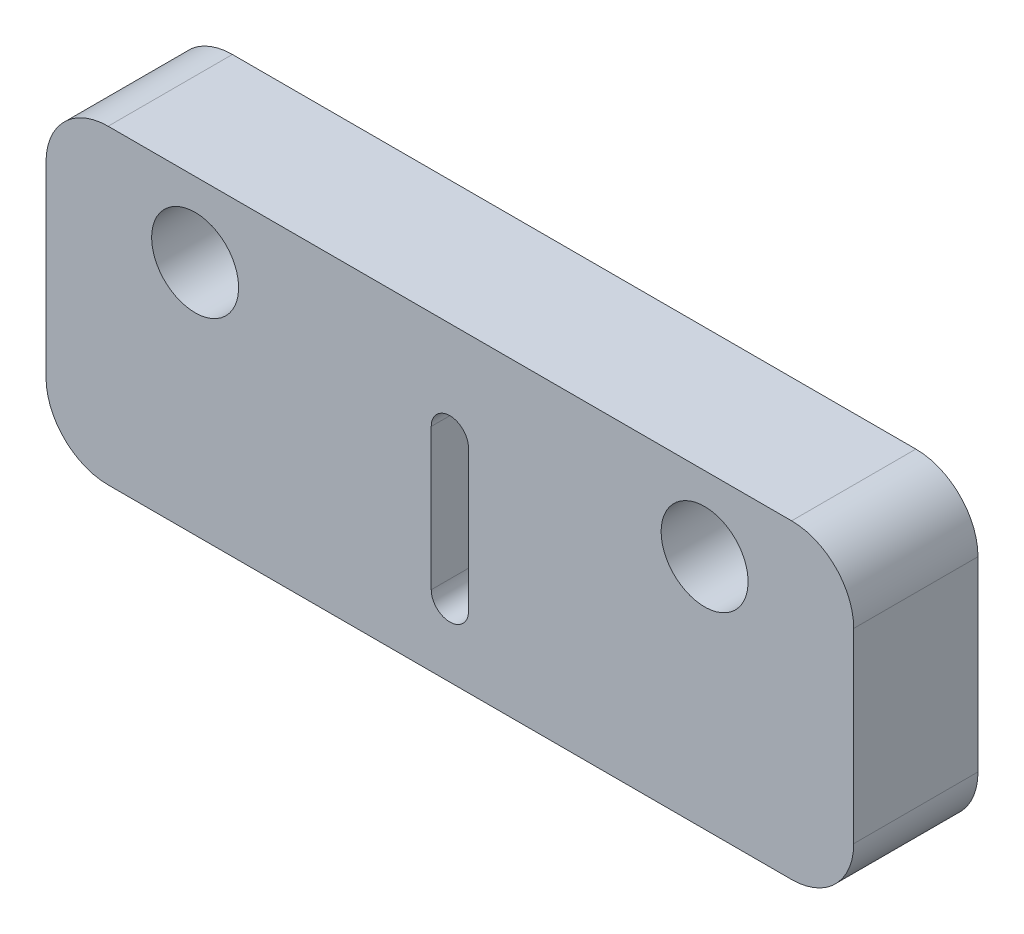
ISO-10303-21;
HEADER;
FILE_DESCRIPTION(('STEP AP214'),'2;1');
FILE_NAME('part.step','',(''),(''),'','','');
FILE_SCHEMA(('AUTOMOTIVE_DESIGN { 1 0 10303 214 1 1 1 1 }'));
ENDSEC;
DATA;
#1=APPLICATION_CONTEXT('core data for automotive mechanical design processes');
#2=APPLICATION_PROTOCOL_DEFINITION('international standard','automotive_design',2000,#1);
#3=PRODUCT_CONTEXT('',#1,'mechanical');
#4=PRODUCT('Part','Part','',(#3));
#5=PRODUCT_RELATED_PRODUCT_CATEGORY('part','',(#4));
#6=PRODUCT_DEFINITION_FORMATION('','',#4);
#7=PRODUCT_DEFINITION_CONTEXT('part definition',#1,'design');
#8=PRODUCT_DEFINITION('design','',#6,#7);
#9=PRODUCT_DEFINITION_SHAPE('','',#8);
#10=(LENGTH_UNIT() NAMED_UNIT(*) SI_UNIT(.MILLI.,.METRE.));
#11=(NAMED_UNIT(*) PLANE_ANGLE_UNIT() SI_UNIT($,.RADIAN.));
#12=(NAMED_UNIT(*) SI_UNIT($,.STERADIAN.) SOLID_ANGLE_UNIT());
#13=UNCERTAINTY_MEASURE_WITH_UNIT(LENGTH_MEASURE(1.E-05),#10,'distance_accuracy_value','');
#14=(GEOMETRIC_REPRESENTATION_CONTEXT(3) GLOBAL_UNCERTAINTY_ASSIGNED_CONTEXT((#13)) GLOBAL_UNIT_ASSIGNED_CONTEXT((#10,
#11,#12)) REPRESENTATION_CONTEXT('',''));
#15=CARTESIAN_POINT('',(0.,0.,0.));
#16=DIRECTION('',(0.,0.,1.));
#17=DIRECTION('',(1.,0.,0.));
#18=AXIS2_PLACEMENT_3D('',#15,#16,#17);
#19=CARTESIAN_POINT('',(-30.187265917603,25.,-10.3464419475655));
#20=DIRECTION('',(1.,0.,0.));
#21=DIRECTION('',(0.,0.,-1.));
#22=AXIS2_PLACEMENT_3D('',#19,#20,#21);
#23=PLANE('',#22);
#24=DIRECTION('',(0.,-1.,0.));
#25=VECTOR('',#24,1.);
#26=CARTESIAN_POINT('',(-30.187265917603,25.,-10.3464419475655));
#27=LINE('',#26,#25);
#28=CARTESIAN_POINT('',(-30.187265917603,20.,-10.3464419475655));
#29=VERTEX_POINT('',#28);
#30=CARTESIAN_POINT('',(-30.187265917603,5.,-10.3464419475655));
#31=VERTEX_POINT('',#30);
#32=EDGE_CURVE('E205',#29,#31,#27,.T.);
#33=ORIENTED_EDGE('',*,*,#32,.T.);
#34=DIRECTION('',(0.,0.,1.));
#35=VECTOR('',#34,1.);
#36=CARTESIAN_POINT('',(-30.187265917603,5.,-10.3464419475655));
#37=LINE('',#36,#35);
#38=CARTESIAN_POINT('',(-30.187265917603,5.,-0.346441947565543));
#39=VERTEX_POINT('',#38);
#40=EDGE_CURVE('E229',#31,#39,#37,.T.);
#41=ORIENTED_EDGE('',*,*,#40,.T.);
#42=DIRECTION('',(0.,-1.,0.));
#43=VECTOR('',#42,1.);
#44=CARTESIAN_POINT('',(-30.187265917603,25.,-0.346441947565543));
#45=LINE('',#44,#43);
#46=CARTESIAN_POINT('',(-30.187265917603,20.,-0.346441947565543));
#47=VERTEX_POINT('',#46);
#48=EDGE_CURVE('E222',#47,#39,#45,.T.);
#49=ORIENTED_EDGE('',*,*,#48,.F.);
#50=DIRECTION('',(0.,0.,1.));
#51=VECTOR('',#50,1.);
#52=CARTESIAN_POINT('',(-30.187265917603,20.,-10.3464419475655));
#53=LINE('',#52,#51);
#54=EDGE_CURVE('E226',#47,#29,#53,.F.);
#55=ORIENTED_EDGE('',*,*,#54,.T.);
#56=EDGE_LOOP('',(#33,#41,#49,#55));
#57=FACE_BOUND('',#56,.T.);
#58=ADVANCED_FACE('F39',(#57),#23,.F.);
#59=CARTESIAN_POINT('',(-30.187265917603,25.,-0.346441947565543));
#60=DIRECTION('',(0.,0.,-1.));
#61=DIRECTION('',(-1.,0.,0.));
#62=AXIS2_PLACEMENT_3D('',#59,#60,#61);
#63=PLANE('',#62);
#64=CARTESIAN_POINT('',(-18.187265917603,19.,-0.346441947565543));
#65=DIRECTION('',(0.,0.,-1.));
#66=DIRECTION('',(-1.,0.,0.));
#67=AXIS2_PLACEMENT_3D('',#64,#65,#66);
#68=CIRCLE('',#67,3.5);
#69=CARTESIAN_POINT('',(-21.687265917603,19.,-0.346441947565543));
#70=VERTEX_POINT('',#69);
#71=EDGE_CURVE('E191',#70,#70,#68,.T.);
#72=ORIENTED_EDGE('',*,*,#71,.T.);
#73=EDGE_LOOP('',(#72));
#74=FACE_BOUND('',#73,.T.);
#75=CARTESIAN_POINT('',(2.31273408239698,17.0770061257119,-0.346441947565543));
#76=DIRECTION('',(0.,0.,-1.));
#77=DIRECTION('',(-1.,0.,0.));
#78=AXIS2_PLACEMENT_3D('',#75,#76,#77);
#79=CIRCLE('',#78,1.49999999999999);
#80=CARTESIAN_POINT('',(0.812734082396988,17.0770061257119,-0.346441947565543));
#81=VERTEX_POINT('',#80);
#82=CARTESIAN_POINT('',(3.81273408239698,17.0770061257119,-0.346441947565543));
#83=VERTEX_POINT('',#82);
#84=EDGE_CURVE('E186',#81,#83,#79,.T.);
#85=ORIENTED_EDGE('',*,*,#84,.T.);
#86=DIRECTION('',(0.,-1.,0.));
#87=VECTOR('',#86,1.);
#88=CARTESIAN_POINT('',(3.81273408239698,25.,-0.346441947565543));
#89=LINE('',#88,#87);
#90=CARTESIAN_POINT('',(3.81273408239698,5.69617233331243,-0.346441947565543));
#91=VERTEX_POINT('',#90);
#92=EDGE_CURVE('E138',#83,#91,#89,.T.);
#93=ORIENTED_EDGE('',*,*,#92,.T.);
#94=CARTESIAN_POINT('',(2.31273408239698,5.69617233331243,-0.346441947565543));
#95=DIRECTION('',(0.,0.,-1.));
#96=DIRECTION('',(-1.,0.,0.));
#97=AXIS2_PLACEMENT_3D('',#94,#95,#96);
#98=CIRCLE('',#97,1.49999999999999);
#99=CARTESIAN_POINT('',(0.812734082396988,5.69617233331243,-0.346441947565543));
#100=VERTEX_POINT('',#99);
#101=EDGE_CURVE('E178',#91,#100,#98,.T.);
#102=ORIENTED_EDGE('',*,*,#101,.T.);
#103=DIRECTION('',(0.,-1.,0.));
#104=VECTOR('',#103,1.);
#105=CARTESIAN_POINT('',(0.812734082396988,25.,-0.346441947565543));
#106=LINE('',#105,#104);
#107=EDGE_CURVE('E182',#81,#100,#106,.T.);
#108=ORIENTED_EDGE('',*,*,#107,.F.);
#109=EDGE_LOOP('',(#85,#93,#102,#108));
#110=FACE_BOUND('',#109,.T.);
#111=CARTESIAN_POINT('',(22.812734082397,19.,-0.346441947565543));
#112=DIRECTION('',(0.,0.,-1.));
#113=DIRECTION('',(-1.,0.,0.));
#114=AXIS2_PLACEMENT_3D('',#111,#112,#113);
#115=CIRCLE('',#114,3.5);
#116=CARTESIAN_POINT('',(19.312734082397,19.,-0.346441947565543));
#117=VERTEX_POINT('',#116);
#118=EDGE_CURVE('E167',#117,#117,#115,.T.);
#119=ORIENTED_EDGE('',*,*,#118,.T.);
#120=EDGE_LOOP('',(#119));
#121=FACE_BOUND('',#120,.T.);
#122=ORIENTED_EDGE('',*,*,#48,.T.);
#123=CARTESIAN_POINT('',(-25.187265917603,5.,-0.346441947565543));
#124=DIRECTION('',(0.,0.,-1.));
#125=DIRECTION('',(-1.,0.,0.));
#126=AXIS2_PLACEMENT_3D('',#123,#124,#125);
#127=CIRCLE('',#126,5.);
#128=CARTESIAN_POINT('',(-25.187265917603,0.,-0.346441947565543));
#129=VERTEX_POINT('',#128);
#130=EDGE_CURVE('E242',#39,#129,#127,.F.);
#131=ORIENTED_EDGE('',*,*,#130,.T.);
#132=DIRECTION('',(1.,0.,0.));
#133=VECTOR('',#132,1.);
#134=CARTESIAN_POINT('',(-30.187265917603,0.,-0.346441947565543));
#135=LINE('',#134,#133);
#136=CARTESIAN_POINT('',(29.812734082397,0.,-0.346441947565543));
#137=VERTEX_POINT('',#136);
#138=EDGE_CURVE('E195',#129,#137,#135,.T.);
#139=ORIENTED_EDGE('',*,*,#138,.T.);
#140=CARTESIAN_POINT('',(29.812734082397,5.,-0.346441947565543));
#141=DIRECTION('',(0.,0.,-1.));
#142=DIRECTION('',(-1.,0.,0.));
#143=AXIS2_PLACEMENT_3D('',#140,#141,#142);
#144=CIRCLE('',#143,5.);
#145=CARTESIAN_POINT('',(34.812734082397,5.,-0.346441947565543));
#146=VERTEX_POINT('',#145);
#147=EDGE_CURVE('E239',#137,#146,#144,.F.);
#148=ORIENTED_EDGE('',*,*,#147,.T.);
#149=DIRECTION('',(0.,-1.,0.));
#150=VECTOR('',#149,1.);
#151=CARTESIAN_POINT('',(34.812734082397,25.,-0.346441947565543));
#152=LINE('',#151,#150);
#153=CARTESIAN_POINT('',(34.812734082397,20.,-0.346441947565543));
#154=VERTEX_POINT('',#153);
#155=EDGE_CURVE('E218',#154,#146,#152,.T.);
#156=ORIENTED_EDGE('',*,*,#155,.F.);
#157=CARTESIAN_POINT('',(29.812734082397,20.,-0.346441947565543));
#158=DIRECTION('',(0.,0.,-1.));
#159=DIRECTION('',(-1.,0.,0.));
#160=AXIS2_PLACEMENT_3D('',#157,#158,#159);
#161=CIRCLE('',#160,5.);
#162=CARTESIAN_POINT('',(29.812734082397,25.,-0.346441947565543));
#163=VERTEX_POINT('',#162);
#164=EDGE_CURVE('E236',#154,#163,#161,.F.);
#165=ORIENTED_EDGE('',*,*,#164,.T.);
#166=DIRECTION('',(1.,0.,0.));
#167=VECTOR('',#166,1.);
#168=CARTESIAN_POINT('',(-30.187265917603,25.,-0.346441947565543));
#169=LINE('',#168,#167);
#170=CARTESIAN_POINT('',(-25.187265917603,25.,-0.346441947565543));
#171=VERTEX_POINT('',#170);
#172=EDGE_CURVE('E196',#171,#163,#169,.T.);
#173=ORIENTED_EDGE('',*,*,#172,.F.);
#174=CARTESIAN_POINT('',(-25.187265917603,20.,-0.346441947565543));
#175=DIRECTION('',(0.,0.,-1.));
#176=DIRECTION('',(-1.,0.,0.));
#177=AXIS2_PLACEMENT_3D('',#174,#175,#176);
#178=CIRCLE('',#177,5.);
#179=EDGE_CURVE('E233',#171,#47,#178,.F.);
#180=ORIENTED_EDGE('',*,*,#179,.T.);
#181=EDGE_LOOP('',(#122,#131,#139,#148,#156,#165,#173,#180));
#182=FACE_BOUND('',#181,.T.);
#183=ADVANCED_FACE('F276',(#74,#110,#121,#182),#63,.F.);
#184=CARTESIAN_POINT('',(34.812734082397,25.,-10.3464419475655));
#185=DIRECTION('',(-1.,0.,0.));
#186=DIRECTION('',(0.,0.,1.));
#187=AXIS2_PLACEMENT_3D('',#184,#185,#186);
#188=PLANE('',#187);
#189=ORIENTED_EDGE('',*,*,#155,.T.);
#190=DIRECTION('',(0.,0.,-1.));
#191=VECTOR('',#190,1.);
#192=CARTESIAN_POINT('',(34.812734082397,5.,-10.3464419475655));
#193=LINE('',#192,#191);
#194=CARTESIAN_POINT('',(34.812734082397,5.,-10.3464419475655));
#195=VERTEX_POINT('',#194);
#196=EDGE_CURVE('E264',#146,#195,#193,.T.);
#197=ORIENTED_EDGE('',*,*,#196,.T.);
#198=DIRECTION('',(0.,-1.,0.));
#199=VECTOR('',#198,1.);
#200=CARTESIAN_POINT('',(34.812734082397,25.,-10.3464419475655));
#201=LINE('',#200,#199);
#202=CARTESIAN_POINT('',(34.812734082397,20.,-10.3464419475655));
#203=VERTEX_POINT('',#202);
#204=EDGE_CURVE('E215',#203,#195,#201,.T.);
#205=ORIENTED_EDGE('',*,*,#204,.F.);
#206=DIRECTION('',(0.,0.,-1.));
#207=VECTOR('',#206,1.);
#208=CARTESIAN_POINT('',(34.812734082397,20.,-0.346441947565543));
#209=LINE('',#208,#207);
#210=EDGE_CURVE('E261',#203,#154,#209,.F.);
#211=ORIENTED_EDGE('',*,*,#210,.T.);
#212=EDGE_LOOP('',(#189,#197,#205,#211));
#213=FACE_BOUND('',#212,.T.);
#214=ADVANCED_FACE('F298',(#213),#188,.F.);
#215=CARTESIAN_POINT('',(-30.187265917603,25.,-10.3464419475655));
#216=DIRECTION('',(0.,0.,1.));
#217=DIRECTION('',(1.,0.,0.));
#218=AXIS2_PLACEMENT_3D('',#215,#216,#217);
#219=PLANE('',#218);
#220=CARTESIAN_POINT('',(-18.187265917603,19.,-10.3464419475655));
#221=DIRECTION('',(0.,0.,-1.));
#222=DIRECTION('',(-1.,0.,0.));
#223=AXIS2_PLACEMENT_3D('',#220,#221,#222);
#224=CIRCLE('',#223,3.5);
#225=CARTESIAN_POINT('',(-21.687265917603,19.,-10.3464419475655));
#226=VERTEX_POINT('',#225);
#227=EDGE_CURVE('E162',#226,#226,#224,.T.);
#228=ORIENTED_EDGE('',*,*,#227,.F.);
#229=EDGE_LOOP('',(#228));
#230=FACE_BOUND('',#229,.T.);
#231=CARTESIAN_POINT('',(2.31273408239698,5.69617233331243,-10.3464419475655));
#232=DIRECTION('',(0.,0.,-1.));
#233=DIRECTION('',(-1.,0.,0.));
#234=AXIS2_PLACEMENT_3D('',#231,#232,#233);
#235=CIRCLE('',#234,1.49999999999999);
#236=CARTESIAN_POINT('',(3.81273408239698,5.69617233331243,-10.3464419475655));
#237=VERTEX_POINT('',#236);
#238=CARTESIAN_POINT('',(0.812734082396988,5.69617233331243,-10.3464419475655));
#239=VERTEX_POINT('',#238);
#240=EDGE_CURVE('E160',#237,#239,#235,.T.);
#241=ORIENTED_EDGE('',*,*,#240,.F.);
#242=DIRECTION('',(0.,-1.,0.));
#243=VECTOR('',#242,1.);
#244=CARTESIAN_POINT('',(3.81273408239698,0.,-10.3464419475655));
#245=LINE('',#244,#243);
#246=CARTESIAN_POINT('',(3.81273408239698,17.0770061257119,-10.3464419475655));
#247=VERTEX_POINT('',#246);
#248=EDGE_CURVE('E135',#247,#237,#245,.T.);
#249=ORIENTED_EDGE('',*,*,#248,.F.);
#250=CARTESIAN_POINT('',(2.31273408239698,17.0770061257119,-10.3464419475655));
#251=DIRECTION('',(0.,0.,-1.));
#252=DIRECTION('',(-1.,0.,0.));
#253=AXIS2_PLACEMENT_3D('',#250,#251,#252);
#254=CIRCLE('',#253,1.49999999999999);
#255=CARTESIAN_POINT('',(0.812734082396988,17.0770061257119,-10.3464419475655));
#256=VERTEX_POINT('',#255);
#257=EDGE_CURVE('E146',#256,#247,#254,.T.);
#258=ORIENTED_EDGE('',*,*,#257,.F.);
#259=DIRECTION('',(0.,-1.,0.));
#260=VECTOR('',#259,1.);
#261=CARTESIAN_POINT('',(0.812734082396988,0.,-10.3464419475655));
#262=LINE('',#261,#260);
#263=EDGE_CURVE('E153',#256,#239,#262,.T.);
#264=ORIENTED_EDGE('',*,*,#263,.T.);
#265=EDGE_LOOP('',(#241,#249,#258,#264));
#266=FACE_BOUND('',#265,.T.);
#267=CARTESIAN_POINT('',(22.812734082397,19.,-10.3464419475655));
#268=DIRECTION('',(0.,0.,-1.));
#269=DIRECTION('',(-1.,0.,0.));
#270=AXIS2_PLACEMENT_3D('',#267,#268,#269);
#271=CIRCLE('',#270,3.5);
#272=CARTESIAN_POINT('',(19.312734082397,19.,-10.3464419475655));
#273=VERTEX_POINT('',#272);
#274=EDGE_CURVE('E143',#273,#273,#271,.T.);
#275=ORIENTED_EDGE('',*,*,#274,.F.);
#276=EDGE_LOOP('',(#275));
#277=FACE_BOUND('',#276,.T.);
#278=DIRECTION('',(-1.,0.,0.));
#279=VECTOR('',#278,1.);
#280=CARTESIAN_POINT('',(-30.187265917603,0.,-10.3464419475655));
#281=LINE('',#280,#279);
#282=CARTESIAN_POINT('',(29.812734082397,0.,-10.3464419475655));
#283=VERTEX_POINT('',#282);
#284=CARTESIAN_POINT('',(-25.187265917603,0.,-10.3464419475655));
#285=VERTEX_POINT('',#284);
#286=EDGE_CURVE('E201',#283,#285,#281,.T.);
#287=ORIENTED_EDGE('',*,*,#286,.T.);
#288=CARTESIAN_POINT('',(-25.187265917603,5.,-10.3464419475655));
#289=DIRECTION('',(0.,0.,1.));
#290=DIRECTION('',(1.,0.,0.));
#291=AXIS2_PLACEMENT_3D('',#288,#289,#290);
#292=CIRCLE('',#291,5.);
#293=EDGE_CURVE('E258',#285,#31,#292,.F.);
#294=ORIENTED_EDGE('',*,*,#293,.T.);
#295=ORIENTED_EDGE('',*,*,#32,.F.);
#296=CARTESIAN_POINT('',(-25.187265917603,20.,-10.3464419475655));
#297=DIRECTION('',(0.,0.,1.));
#298=DIRECTION('',(1.,0.,0.));
#299=AXIS2_PLACEMENT_3D('',#296,#297,#298);
#300=CIRCLE('',#299,5.);
#301=CARTESIAN_POINT('',(-25.187265917603,25.,-10.3464419475655));
#302=VERTEX_POINT('',#301);
#303=EDGE_CURVE('E251',#29,#302,#300,.F.);
#304=ORIENTED_EDGE('',*,*,#303,.T.);
#305=DIRECTION('',(-1.,0.,0.));
#306=VECTOR('',#305,1.);
#307=CARTESIAN_POINT('',(-30.187265917603,25.,-10.3464419475655));
#308=LINE('',#307,#306);
#309=CARTESIAN_POINT('',(29.812734082397,25.,-10.3464419475655));
#310=VERTEX_POINT('',#309);
#311=EDGE_CURVE('E200',#310,#302,#308,.T.);
#312=ORIENTED_EDGE('',*,*,#311,.F.);
#313=CARTESIAN_POINT('',(29.812734082397,20.,-10.3464419475655));
#314=DIRECTION('',(0.,0.,1.));
#315=DIRECTION('',(1.,0.,0.));
#316=AXIS2_PLACEMENT_3D('',#313,#314,#315);
#317=CIRCLE('',#316,5.);
#318=EDGE_CURVE('E63',#310,#203,#317,.F.);
#319=ORIENTED_EDGE('',*,*,#318,.T.);
#320=ORIENTED_EDGE('',*,*,#204,.T.);
#321=CARTESIAN_POINT('',(29.812734082397,5.,-10.3464419475655));
#322=DIRECTION('',(0.,0.,1.));
#323=DIRECTION('',(1.,0.,0.));
#324=AXIS2_PLACEMENT_3D('',#321,#322,#323);
#325=CIRCLE('',#324,5.);
#326=EDGE_CURVE('E55',#195,#283,#325,.F.);
#327=ORIENTED_EDGE('',*,*,#326,.T.);
#328=EDGE_LOOP('',(#287,#294,#295,#304,#312,#319,#320,#327));
#329=FACE_BOUND('',#328,.T.);
#330=ADVANCED_FACE('F157',(#230,#266,#277,#329),#219,.F.);
#331=CARTESIAN_POINT('',(0.,25.,0.));
#332=DIRECTION('',(0.,1.,0.));
#333=DIRECTION('',(0.,0.,1.));
#334=AXIS2_PLACEMENT_3D('',#331,#332,#333);
#335=PLANE('',#334);
#336=ORIENTED_EDGE('',*,*,#172,.T.);
#337=DIRECTION('',(0.,0.,-1.));
#338=VECTOR('',#337,1.);
#339=CARTESIAN_POINT('',(29.812734082397,25.,-10.3464419475655));
#340=LINE('',#339,#338);
#341=EDGE_CURVE('E11',#163,#310,#340,.T.);
#342=ORIENTED_EDGE('',*,*,#341,.T.);
#343=ORIENTED_EDGE('',*,*,#311,.T.);
#344=DIRECTION('',(0.,0.,1.));
#345=VECTOR('',#344,1.);
#346=CARTESIAN_POINT('',(-25.187265917603,25.,-0.346441947565539));
#347=LINE('',#346,#345);
#348=EDGE_CURVE('E48',#302,#171,#347,.T.);
#349=ORIENTED_EDGE('',*,*,#348,.T.);
#350=EDGE_LOOP('',(#336,#342,#343,#349));
#351=FACE_BOUND('',#350,.T.);
#352=ADVANCED_FACE('F271',(#351),#335,.T.);
#353=CARTESIAN_POINT('',(0.,0.,0.));
#354=DIRECTION('',(0.,1.,0.));
#355=DIRECTION('',(0.,0.,1.));
#356=AXIS2_PLACEMENT_3D('',#353,#354,#355);
#357=PLANE('',#356);
#358=ORIENTED_EDGE('',*,*,#138,.F.);
#359=DIRECTION('',(0.,0.,1.));
#360=VECTOR('',#359,1.);
#361=CARTESIAN_POINT('',(-25.187265917603,0.,0.));
#362=LINE('',#361,#360);
#363=EDGE_CURVE('E248',#129,#285,#362,.F.);
#364=ORIENTED_EDGE('',*,*,#363,.T.);
#365=ORIENTED_EDGE('',*,*,#286,.F.);
#366=DIRECTION('',(0.,0.,-1.));
#367=VECTOR('',#366,1.);
#368=CARTESIAN_POINT('',(29.812734082397,0.,0.));
#369=LINE('',#368,#367);
#370=EDGE_CURVE('E245',#283,#137,#369,.F.);
#371=ORIENTED_EDGE('',*,*,#370,.T.);
#372=EDGE_LOOP('',(#358,#364,#365,#371));
#373=FACE_BOUND('',#372,.T.);
#374=ADVANCED_FACE('F292',(#373),#357,.F.);
#375=CARTESIAN_POINT('',(22.812734082397,19.,14.6535580524345));
#376=DIRECTION('',(0.,0.,-1.));
#377=DIRECTION('',(-1.,0.,0.));
#378=AXIS2_PLACEMENT_3D('',#375,#376,#377);
#379=CYLINDRICAL_SURFACE('',#378,3.5);
#380=ORIENTED_EDGE('',*,*,#274,.T.);
#381=EDGE_LOOP('',(#380));
#382=FACE_BOUND('',#381,.T.);
#383=ORIENTED_EDGE('',*,*,#118,.F.);
#384=EDGE_LOOP('',(#383));
#385=FACE_BOUND('',#384,.T.);
#386=ADVANCED_FACE('F351',(#382,#385),#379,.F.);
#387=CARTESIAN_POINT('',(3.81273408239698,0.,14.6535580524345));
#388=DIRECTION('',(1.,0.,0.));
#389=DIRECTION('',(0.,0.,-1.));
#390=AXIS2_PLACEMENT_3D('',#387,#388,#389);
#391=PLANE('',#390);
#392=DIRECTION('',(0.,0.,-1.));
#393=VECTOR('',#392,1.);
#394=CARTESIAN_POINT('',(3.81273408239698,17.0770061257119,14.6535580524345));
#395=LINE('',#394,#393);
#396=EDGE_CURVE('E130',#83,#247,#395,.T.);
#397=ORIENTED_EDGE('',*,*,#396,.T.);
#398=ORIENTED_EDGE('',*,*,#248,.T.);
#399=DIRECTION('',(0.,0.,-1.));
#400=VECTOR('',#399,1.);
#401=CARTESIAN_POINT('',(3.81273408239698,5.69617233331243,14.6535580524345));
#402=LINE('',#401,#400);
#403=EDGE_CURVE('E154',#91,#237,#402,.T.);
#404=ORIENTED_EDGE('',*,*,#403,.F.);
#405=ORIENTED_EDGE('',*,*,#92,.F.);
#406=EDGE_LOOP('',(#397,#398,#404,#405));
#407=FACE_BOUND('',#406,.T.);
#408=ADVANCED_FACE('F132',(#407),#391,.F.);
#409=CARTESIAN_POINT('',(2.31273408239698,17.0770061257119,14.6535580524345));
#410=DIRECTION('',(0.,0.,-1.));
#411=DIRECTION('',(-1.,0.,0.));
#412=AXIS2_PLACEMENT_3D('',#409,#410,#411);
#413=CYLINDRICAL_SURFACE('',#412,1.49999999999999);
#414=DIRECTION('',(0.,0.,-1.));
#415=VECTOR('',#414,1.);
#416=CARTESIAN_POINT('',(0.812734082396988,17.0770061257119,14.6535580524345));
#417=LINE('',#416,#415);
#418=EDGE_CURVE('E142',#81,#256,#417,.T.);
#419=ORIENTED_EDGE('',*,*,#418,.T.);
#420=ORIENTED_EDGE('',*,*,#257,.T.);
#421=ORIENTED_EDGE('',*,*,#396,.F.);
#422=ORIENTED_EDGE('',*,*,#84,.F.);
#423=EDGE_LOOP('',(#419,#420,#421,#422));
#424=FACE_BOUND('',#423,.T.);
#425=ADVANCED_FACE('F147',(#424),#413,.F.);
#426=CARTESIAN_POINT('',(0.812734082396988,0.,14.6535580524345));
#427=DIRECTION('',(1.,0.,0.));
#428=DIRECTION('',(0.,0.,-1.));
#429=AXIS2_PLACEMENT_3D('',#426,#427,#428);
#430=PLANE('',#429);
#431=ORIENTED_EDGE('',*,*,#107,.T.);
#432=DIRECTION('',(0.,0.,-1.));
#433=VECTOR('',#432,1.);
#434=CARTESIAN_POINT('',(0.812734082396988,5.69617233331243,14.6535580524345));
#435=LINE('',#434,#433);
#436=EDGE_CURVE('E440',#100,#239,#435,.T.);
#437=ORIENTED_EDGE('',*,*,#436,.T.);
#438=ORIENTED_EDGE('',*,*,#263,.F.);
#439=ORIENTED_EDGE('',*,*,#418,.F.);
#440=EDGE_LOOP('',(#431,#437,#438,#439));
#441=FACE_BOUND('',#440,.T.);
#442=ADVANCED_FACE('F398',(#441),#430,.T.);
#443=CARTESIAN_POINT('',(2.31273408239698,5.69617233331243,14.6535580524345));
#444=DIRECTION('',(0.,0.,-1.));
#445=DIRECTION('',(-1.,0.,0.));
#446=AXIS2_PLACEMENT_3D('',#443,#444,#445);
#447=CYLINDRICAL_SURFACE('',#446,1.49999999999999);
#448=ORIENTED_EDGE('',*,*,#403,.T.);
#449=ORIENTED_EDGE('',*,*,#240,.T.);
#450=ORIENTED_EDGE('',*,*,#436,.F.);
#451=ORIENTED_EDGE('',*,*,#101,.F.);
#452=EDGE_LOOP('',(#448,#449,#450,#451));
#453=FACE_BOUND('',#452,.T.);
#454=ADVANCED_FACE('F388',(#453),#447,.F.);
#455=CARTESIAN_POINT('',(-18.187265917603,19.,14.6535580524345));
#456=DIRECTION('',(0.,0.,-1.));
#457=DIRECTION('',(-1.,0.,0.));
#458=AXIS2_PLACEMENT_3D('',#455,#456,#457);
#459=CYLINDRICAL_SURFACE('',#458,3.5);
#460=ORIENTED_EDGE('',*,*,#227,.T.);
#461=EDGE_LOOP('',(#460));
#462=FACE_BOUND('',#461,.T.);
#463=ORIENTED_EDGE('',*,*,#71,.F.);
#464=EDGE_LOOP('',(#463));
#465=FACE_BOUND('',#464,.T.);
#466=ADVANCED_FACE('F316',(#462,#465),#459,.F.);
#467=CARTESIAN_POINT('',(-25.187265917603,5.,-10.3464419475655));
#468=DIRECTION('',(0.,0.,1.));
#469=DIRECTION('',(1.,0.,0.));
#470=AXIS2_PLACEMENT_3D('',#467,#468,#469);
#471=CYLINDRICAL_SURFACE('',#470,5.);
#472=ORIENTED_EDGE('',*,*,#293,.F.);
#473=ORIENTED_EDGE('',*,*,#363,.F.);
#474=ORIENTED_EDGE('',*,*,#130,.F.);
#475=ORIENTED_EDGE('',*,*,#40,.F.);
#476=EDGE_LOOP('',(#472,#473,#474,#475));
#477=FACE_BOUND('',#476,.T.);
#478=ADVANCED_FACE('F295',(#477),#471,.T.);
#479=CARTESIAN_POINT('',(29.812734082397,5.,-10.3464419475655));
#480=DIRECTION('',(0.,0.,-1.));
#481=DIRECTION('',(-1.,0.,0.));
#482=AXIS2_PLACEMENT_3D('',#479,#480,#481);
#483=CYLINDRICAL_SURFACE('',#482,5.);
#484=ORIENTED_EDGE('',*,*,#147,.F.);
#485=ORIENTED_EDGE('',*,*,#370,.F.);
#486=ORIENTED_EDGE('',*,*,#326,.F.);
#487=ORIENTED_EDGE('',*,*,#196,.F.);
#488=EDGE_LOOP('',(#484,#485,#486,#487));
#489=FACE_BOUND('',#488,.T.);
#490=ADVANCED_FACE('F296',(#489),#483,.T.);
#491=CARTESIAN_POINT('',(29.812734082397,20.,0.));
#492=DIRECTION('',(0.,0.,1.));
#493=DIRECTION('',(1.,0.,0.));
#494=AXIS2_PLACEMENT_3D('',#491,#492,#493);
#495=CYLINDRICAL_SURFACE('',#494,5.);
#496=ORIENTED_EDGE('',*,*,#164,.F.);
#497=ORIENTED_EDGE('',*,*,#210,.F.);
#498=ORIENTED_EDGE('',*,*,#318,.F.);
#499=ORIENTED_EDGE('',*,*,#341,.F.);
#500=EDGE_LOOP('',(#496,#497,#498,#499));
#501=FACE_BOUND('',#500,.T.);
#502=ADVANCED_FACE('F282',(#501),#495,.T.);
#503=CARTESIAN_POINT('',(-25.187265917603,20.,0.));
#504=DIRECTION('',(0.,0.,-1.));
#505=DIRECTION('',(-1.,0.,0.));
#506=AXIS2_PLACEMENT_3D('',#503,#504,#505);
#507=CYLINDRICAL_SURFACE('',#506,5.);
#508=ORIENTED_EDGE('',*,*,#303,.F.);
#509=ORIENTED_EDGE('',*,*,#54,.F.);
#510=ORIENTED_EDGE('',*,*,#179,.F.);
#511=ORIENTED_EDGE('',*,*,#348,.F.);
#512=EDGE_LOOP('',(#508,#509,#510,#511));
#513=FACE_BOUND('',#512,.T.);
#514=ADVANCED_FACE('F41',(#513),#507,.T.);
#515=CLOSED_SHELL('',(#58,#183,#214,#330,#352,#374,#386,#408,#425,#442,#454,#466,#478,#490,#502,#514));
#516=MANIFOLD_SOLID_BREP('B2',#515);
#517=ADVANCED_BREP_SHAPE_REPRESENTATION('',(#18,#516),#14);
#518=SHAPE_DEFINITION_REPRESENTATION(#9,#517);
ENDSEC;
END-ISO-10303-21;
